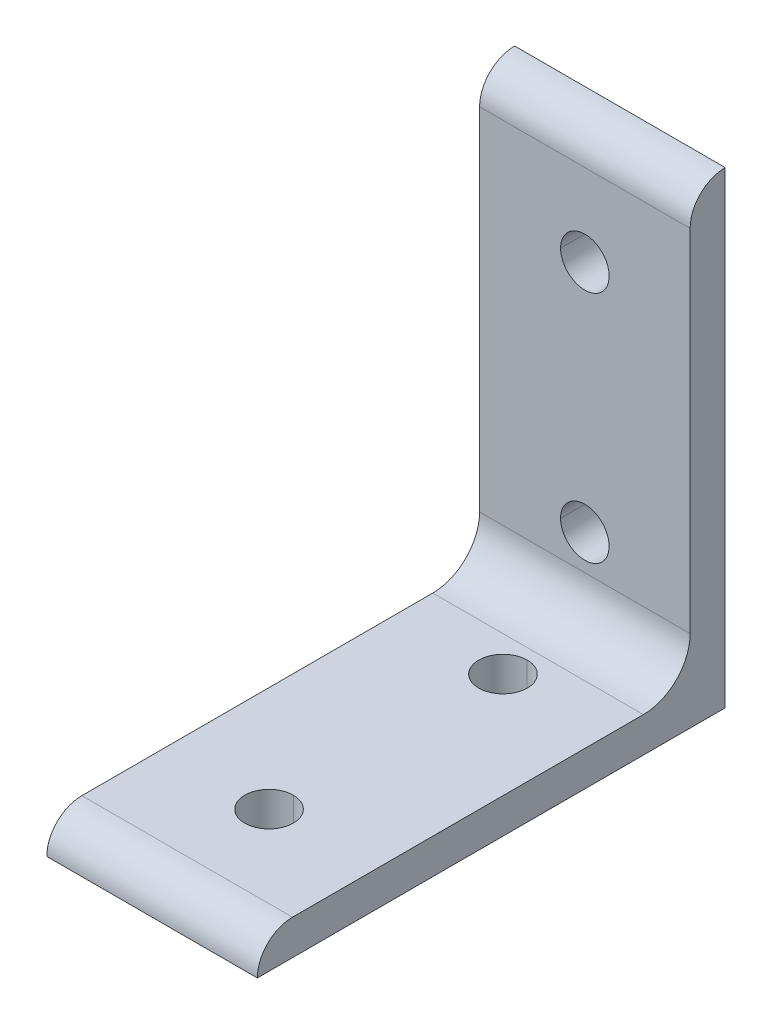
ISO-10303-21;
HEADER;
FILE_DESCRIPTION(('STEP AP214'),'2;1');
FILE_NAME('part.step','',(''),(''),'','','');
FILE_SCHEMA(('AUTOMOTIVE_DESIGN { 1 0 10303 214 1 1 1 1 }'));
ENDSEC;
DATA;
#1=APPLICATION_CONTEXT('core data for automotive mechanical design processes');
#2=APPLICATION_PROTOCOL_DEFINITION('international standard','automotive_design',2000,#1);
#3=PRODUCT_CONTEXT('',#1,'mechanical');
#4=PRODUCT('Part','Part','',(#3));
#5=PRODUCT_RELATED_PRODUCT_CATEGORY('part','',(#4));
#6=PRODUCT_DEFINITION_FORMATION('','',#4);
#7=PRODUCT_DEFINITION_CONTEXT('part definition',#1,'design');
#8=PRODUCT_DEFINITION('design','',#6,#7);
#9=PRODUCT_DEFINITION_SHAPE('','',#8);
#10=(LENGTH_UNIT() NAMED_UNIT(*) SI_UNIT(.MILLI.,.METRE.));
#11=(NAMED_UNIT(*) PLANE_ANGLE_UNIT() SI_UNIT($,.RADIAN.));
#12=(NAMED_UNIT(*) SI_UNIT($,.STERADIAN.) SOLID_ANGLE_UNIT());
#13=UNCERTAINTY_MEASURE_WITH_UNIT(LENGTH_MEASURE(1.E-05),#10,'distance_accuracy_value','');
#14=(GEOMETRIC_REPRESENTATION_CONTEXT(3) GLOBAL_UNCERTAINTY_ASSIGNED_CONTEXT((#13)) GLOBAL_UNIT_ASSIGNED_CONTEXT((#10,
#11,#12)) REPRESENTATION_CONTEXT('',''));
#15=CARTESIAN_POINT('',(0.,0.,0.));
#16=DIRECTION('',(0.,0.,1.));
#17=DIRECTION('',(1.,0.,0.));
#18=AXIS2_PLACEMENT_3D('',#15,#16,#17);
#19=CARTESIAN_POINT('',(18.,-4.64905891561784E-13,74.));
#20=DIRECTION('',(-1.,0.,0.));
#21=DIRECTION('',(0.,-0.707106781186575,-0.70710678118652));
#22=AXIS2_PLACEMENT_3D('',#19,#20,#21);
#23=CYLINDRICAL_SURFACE('',#22,6.00000000000047);
#24=CARTESIAN_POINT('',(-18.,-4.64905891561784E-13,74.));
#25=DIRECTION('',(1.,0.,0.));
#26=DIRECTION('',(0.,0.,-1.));
#27=AXIS2_PLACEMENT_3D('',#24,#25,#26);
#28=CIRCLE('',#27,6.00000000000047);
#29=CARTESIAN_POINT('',(-18.,6.,74.));
#30=VERTEX_POINT('',#29);
#31=CARTESIAN_POINT('',(-18.,0.,80.));
#32=VERTEX_POINT('',#31);
#33=EDGE_CURVE('E11',#30,#32,#28,.T.);
#34=ORIENTED_EDGE('',*,*,#33,.T.);
#35=DIRECTION('',(-1.,0.,0.));
#36=VECTOR('',#35,1.);
#37=CARTESIAN_POINT('',(18.,0.,80.));
#38=LINE('',#37,#36);
#39=CARTESIAN_POINT('',(18.,0.,80.));
#40=VERTEX_POINT('',#39);
#41=EDGE_CURVE('E24',#40,#32,#38,.T.);
#42=ORIENTED_EDGE('',*,*,#41,.F.);
#43=CARTESIAN_POINT('',(18.,-4.64905891561784E-13,74.));
#44=DIRECTION('',(1.,0.,0.));
#45=DIRECTION('',(0.,0.,-1.));
#46=AXIS2_PLACEMENT_3D('',#43,#44,#45);
#47=CIRCLE('',#46,6.00000000000047);
#48=CARTESIAN_POINT('',(18.,6.,74.));
#49=VERTEX_POINT('',#48);
#50=EDGE_CURVE('E305',#49,#40,#47,.T.);
#51=ORIENTED_EDGE('',*,*,#50,.F.);
#52=DIRECTION('',(-1.,0.,0.));
#53=VECTOR('',#52,1.);
#54=CARTESIAN_POINT('',(18.,6.,74.));
#55=LINE('',#54,#53);
#56=EDGE_CURVE('E301',#49,#30,#55,.T.);
#57=ORIENTED_EDGE('',*,*,#56,.T.);
#58=EDGE_LOOP('',(#34,#42,#51,#57));
#59=FACE_BOUND('',#58,.T.);
#60=ADVANCED_FACE('F16',(#59),#23,.T.);
#61=CARTESIAN_POINT('',(18.,6.,14.));
#62=DIRECTION('',(0.,-1.,0.));
#63=DIRECTION('',(0.,0.,-1.));
#64=AXIS2_PLACEMENT_3D('',#61,#62,#63);
#65=PLANE('',#64);
#66=CARTESIAN_POINT('',(0.,6.,60.));
#67=DIRECTION('',(0.,1.,0.));
#68=DIRECTION('',(1.,0.,0.));
#69=AXIS2_PLACEMENT_3D('',#66,#67,#68);
#70=CIRCLE('',#69,4.15);
#71=CARTESIAN_POINT('',(0.,6.,55.85));
#72=VERTEX_POINT('',#71);
#73=CARTESIAN_POINT('',(0.,6.,64.15));
#74=VERTEX_POINT('',#73);
#75=EDGE_CURVE('E296',#72,#74,#70,.T.);
#76=ORIENTED_EDGE('',*,*,#75,.F.);
#77=CARTESIAN_POINT('',(0.,6.,60.));
#78=DIRECTION('',(0.,1.,0.));
#79=DIRECTION('',(0.,0.,1.));
#80=AXIS2_PLACEMENT_3D('',#77,#78,#79);
#81=CIRCLE('',#80,4.15000000000001);
#82=EDGE_CURVE('E291',#74,#72,#81,.T.);
#83=ORIENTED_EDGE('',*,*,#82,.F.);
#84=EDGE_LOOP('',(#76,#83));
#85=FACE_BOUND('',#84,.T.);
#86=CARTESIAN_POINT('',(0.,6.,20.));
#87=DIRECTION('',(0.,1.,0.));
#88=DIRECTION('',(1.,0.,0.));
#89=AXIS2_PLACEMENT_3D('',#86,#87,#88);
#90=CIRCLE('',#89,4.15);
#91=CARTESIAN_POINT('',(0.,6.,15.85));
#92=VERTEX_POINT('',#91);
#93=CARTESIAN_POINT('',(0.,6.,24.15));
#94=VERTEX_POINT('',#93);
#95=EDGE_CURVE('E287',#92,#94,#90,.T.);
#96=ORIENTED_EDGE('',*,*,#95,.F.);
#97=CARTESIAN_POINT('',(0.,6.,20.));
#98=DIRECTION('',(0.,1.,0.));
#99=DIRECTION('',(0.,0.,1.));
#100=AXIS2_PLACEMENT_3D('',#97,#98,#99);
#101=CIRCLE('',#100,4.15);
#102=EDGE_CURVE('E141',#94,#92,#101,.T.);
#103=ORIENTED_EDGE('',*,*,#102,.F.);
#104=EDGE_LOOP('',(#96,#103));
#105=FACE_BOUND('',#104,.T.);
#106=DIRECTION('',(0.,0.,1.));
#107=VECTOR('',#106,1.);
#108=CARTESIAN_POINT('',(-18.,6.,14.));
#109=LINE('',#108,#107);
#110=CARTESIAN_POINT('',(-18.,6.,14.));
#111=VERTEX_POINT('',#110);
#112=EDGE_CURVE('E278',#111,#30,#109,.T.);
#113=ORIENTED_EDGE('',*,*,#112,.T.);
#114=ORIENTED_EDGE('',*,*,#56,.F.);
#115=DIRECTION('',(0.,0.,1.));
#116=VECTOR('',#115,1.);
#117=CARTESIAN_POINT('',(18.,6.,14.));
#118=LINE('',#117,#116);
#119=CARTESIAN_POINT('',(18.,6.,14.));
#120=VERTEX_POINT('',#119);
#121=EDGE_CURVE('E273',#120,#49,#118,.T.);
#122=ORIENTED_EDGE('',*,*,#121,.F.);
#123=DIRECTION('',(-1.,0.,0.));
#124=VECTOR('',#123,1.);
#125=CARTESIAN_POINT('',(18.,6.,14.));
#126=LINE('',#125,#124);
#127=EDGE_CURVE('E268',#120,#111,#126,.T.);
#128=ORIENTED_EDGE('',*,*,#127,.T.);
#129=EDGE_LOOP('',(#113,#114,#122,#128));
#130=FACE_BOUND('',#129,.T.);
#131=ADVANCED_FACE('F322',(#85,#105,#130),#65,.F.);
#132=CARTESIAN_POINT('',(18.,14.,14.));
#133=DIRECTION('',(-1.,0.,0.));
#134=DIRECTION('',(0.,0.707106781186548,0.707106781186548));
#135=AXIS2_PLACEMENT_3D('',#132,#133,#134);
#136=CYLINDRICAL_SURFACE('',#135,8.);
#137=CARTESIAN_POINT('',(-18.,14.,14.));
#138=DIRECTION('',(1.,0.,0.));
#139=DIRECTION('',(0.,0.,-1.));
#140=AXIS2_PLACEMENT_3D('',#137,#138,#139);
#141=CIRCLE('',#140,8.);
#142=CARTESIAN_POINT('',(-18.,14.,6.));
#143=VERTEX_POINT('',#142);
#144=EDGE_CURVE('E262',#111,#143,#141,.T.);
#145=ORIENTED_EDGE('',*,*,#144,.F.);
#146=ORIENTED_EDGE('',*,*,#127,.F.);
#147=CARTESIAN_POINT('',(18.,14.,14.));
#148=DIRECTION('',(1.,0.,0.));
#149=DIRECTION('',(0.,0.,-1.));
#150=AXIS2_PLACEMENT_3D('',#147,#148,#149);
#151=CIRCLE('',#150,8.);
#152=CARTESIAN_POINT('',(18.,14.,6.));
#153=VERTEX_POINT('',#152);
#154=EDGE_CURVE('E258',#120,#153,#151,.T.);
#155=ORIENTED_EDGE('',*,*,#154,.T.);
#156=DIRECTION('',(-1.,0.,0.));
#157=VECTOR('',#156,1.);
#158=CARTESIAN_POINT('',(18.,14.,6.));
#159=LINE('',#158,#157);
#160=EDGE_CURVE('E254',#153,#143,#159,.T.);
#161=ORIENTED_EDGE('',*,*,#160,.T.);
#162=EDGE_LOOP('',(#145,#146,#155,#161));
#163=FACE_BOUND('',#162,.T.);
#164=ADVANCED_FACE('F339',(#163),#136,.F.);
#165=CARTESIAN_POINT('',(18.,74.,6.));
#166=DIRECTION('',(0.,0.,-1.));
#167=DIRECTION('',(-1.,0.,0.));
#168=AXIS2_PLACEMENT_3D('',#165,#166,#167);
#169=PLANE('',#168);
#170=CARTESIAN_POINT('',(0.,60.,6.));
#171=DIRECTION('',(0.,0.,1.));
#172=DIRECTION('',(1.,0.,0.));
#173=AXIS2_PLACEMENT_3D('',#170,#171,#172);
#174=CIRCLE('',#173,4.15);
#175=CARTESIAN_POINT('',(-4.15,60.,6.));
#176=VERTEX_POINT('',#175);
#177=CARTESIAN_POINT('',(4.15,60.,6.));
#178=VERTEX_POINT('',#177);
#179=EDGE_CURVE('E249',#176,#178,#174,.T.);
#180=ORIENTED_EDGE('',*,*,#179,.F.);
#181=CARTESIAN_POINT('',(0.,60.,6.));
#182=DIRECTION('',(0.,0.,1.));
#183=DIRECTION('',(1.,0.,0.));
#184=AXIS2_PLACEMENT_3D('',#181,#182,#183);
#185=CIRCLE('',#184,4.15);
#186=EDGE_CURVE('E244',#178,#176,#185,.T.);
#187=ORIENTED_EDGE('',*,*,#186,.F.);
#188=EDGE_LOOP('',(#180,#187));
#189=FACE_BOUND('',#188,.T.);
#190=CARTESIAN_POINT('',(0.,20.,6.));
#191=DIRECTION('',(0.,0.,1.));
#192=DIRECTION('',(1.,0.,0.));
#193=AXIS2_PLACEMENT_3D('',#190,#191,#192);
#194=CIRCLE('',#193,4.15);
#195=CARTESIAN_POINT('',(-4.15,20.,6.));
#196=VERTEX_POINT('',#195);
#197=CARTESIAN_POINT('',(4.15,20.,6.));
#198=VERTEX_POINT('',#197);
#199=EDGE_CURVE('E239',#196,#198,#194,.T.);
#200=ORIENTED_EDGE('',*,*,#199,.F.);
#201=CARTESIAN_POINT('',(0.,20.,6.));
#202=DIRECTION('',(0.,0.,1.));
#203=DIRECTION('',(1.,0.,0.));
#204=AXIS2_PLACEMENT_3D('',#201,#202,#203);
#205=CIRCLE('',#204,4.15);
#206=EDGE_CURVE('E234',#198,#196,#205,.T.);
#207=ORIENTED_EDGE('',*,*,#206,.F.);
#208=EDGE_LOOP('',(#200,#207));
#209=FACE_BOUND('',#208,.T.);
#210=DIRECTION('',(0.,-1.,0.));
#211=VECTOR('',#210,1.);
#212=CARTESIAN_POINT('',(-18.,74.,6.));
#213=LINE('',#212,#211);
#214=CARTESIAN_POINT('',(-18.,74.,6.));
#215=VERTEX_POINT('',#214);
#216=EDGE_CURVE('E229',#215,#143,#213,.T.);
#217=ORIENTED_EDGE('',*,*,#216,.T.);
#218=ORIENTED_EDGE('',*,*,#160,.F.);
#219=DIRECTION('',(0.,-1.,0.));
#220=VECTOR('',#219,1.);
#221=CARTESIAN_POINT('',(18.,74.,6.));
#222=LINE('',#221,#220);
#223=CARTESIAN_POINT('',(18.,74.,6.));
#224=VERTEX_POINT('',#223);
#225=EDGE_CURVE('E224',#224,#153,#222,.T.);
#226=ORIENTED_EDGE('',*,*,#225,.F.);
#227=DIRECTION('',(-1.,0.,0.));
#228=VECTOR('',#227,1.);
#229=CARTESIAN_POINT('',(18.,74.,6.));
#230=LINE('',#229,#228);
#231=EDGE_CURVE('E220',#224,#215,#230,.T.);
#232=ORIENTED_EDGE('',*,*,#231,.T.);
#233=EDGE_LOOP('',(#217,#218,#226,#232));
#234=FACE_BOUND('',#233,.T.);
#235=ADVANCED_FACE('F337',(#189,#209,#234),#169,.F.);
#236=CARTESIAN_POINT('',(18.,74.,-4.65339572430779E-13));
#237=DIRECTION('',(-1.,0.,0.));
#238=DIRECTION('',(0.,-0.70710678118652,-0.707106781186575));
#239=AXIS2_PLACEMENT_3D('',#236,#237,#238);
#240=CYLINDRICAL_SURFACE('',#239,6.00000000000046);
#241=CARTESIAN_POINT('',(-18.,74.,-4.65339572430779E-13));
#242=DIRECTION('',(1.,0.,0.));
#243=DIRECTION('',(0.,0.,-1.));
#244=AXIS2_PLACEMENT_3D('',#241,#242,#243);
#245=CIRCLE('',#244,6.00000000000046);
#246=CARTESIAN_POINT('',(-18.,80.,0.));
#247=VERTEX_POINT('',#246);
#248=EDGE_CURVE('E215',#247,#215,#245,.T.);
#249=ORIENTED_EDGE('',*,*,#248,.T.);
#250=ORIENTED_EDGE('',*,*,#231,.F.);
#251=CARTESIAN_POINT('',(18.,74.,-4.65339572430779E-13));
#252=DIRECTION('',(1.,0.,0.));
#253=DIRECTION('',(0.,0.,-1.));
#254=AXIS2_PLACEMENT_3D('',#251,#252,#253);
#255=CIRCLE('',#254,6.00000000000046);
#256=CARTESIAN_POINT('',(18.,80.,0.));
#257=VERTEX_POINT('',#256);
#258=EDGE_CURVE('E210',#257,#224,#255,.T.);
#259=ORIENTED_EDGE('',*,*,#258,.F.);
#260=DIRECTION('',(-1.,0.,0.));
#261=VECTOR('',#260,1.);
#262=CARTESIAN_POINT('',(18.,80.,0.));
#263=LINE('',#262,#261);
#264=EDGE_CURVE('E206',#257,#247,#263,.T.);
#265=ORIENTED_EDGE('',*,*,#264,.T.);
#266=EDGE_LOOP('',(#249,#250,#259,#265));
#267=FACE_BOUND('',#266,.T.);
#268=ADVANCED_FACE('F335',(#267),#240,.T.);
#269=CARTESIAN_POINT('',(18.,0.,0.));
#270=DIRECTION('',(0.,0.,1.));
#271=DIRECTION('',(1.,0.,0.));
#272=AXIS2_PLACEMENT_3D('',#269,#270,#271);
#273=PLANE('',#272);
#274=CARTESIAN_POINT('',(0.,60.,0.));
#275=DIRECTION('',(0.,0.,1.));
#276=DIRECTION('',(1.,0.,0.));
#277=AXIS2_PLACEMENT_3D('',#274,#275,#276);
#278=CIRCLE('',#277,4.15);
#279=CARTESIAN_POINT('',(4.15,60.,0.));
#280=VERTEX_POINT('',#279);
#281=CARTESIAN_POINT('',(-4.15,60.,0.));
#282=VERTEX_POINT('',#281);
#283=EDGE_CURVE('E202',#280,#282,#278,.T.);
#284=ORIENTED_EDGE('',*,*,#283,.T.);
#285=CARTESIAN_POINT('',(0.,60.,0.));
#286=DIRECTION('',(0.,0.,1.));
#287=DIRECTION('',(1.,0.,0.));
#288=AXIS2_PLACEMENT_3D('',#285,#286,#287);
#289=CIRCLE('',#288,4.15);
#290=EDGE_CURVE('E198',#282,#280,#289,.T.);
#291=ORIENTED_EDGE('',*,*,#290,.T.);
#292=EDGE_LOOP('',(#284,#291));
#293=FACE_BOUND('',#292,.T.);
#294=CARTESIAN_POINT('',(0.,20.,0.));
#295=DIRECTION('',(0.,0.,1.));
#296=DIRECTION('',(1.,0.,0.));
#297=AXIS2_PLACEMENT_3D('',#294,#295,#296);
#298=CIRCLE('',#297,4.15);
#299=CARTESIAN_POINT('',(4.15,20.,0.));
#300=VERTEX_POINT('',#299);
#301=CARTESIAN_POINT('',(-4.15,20.,0.));
#302=VERTEX_POINT('',#301);
#303=EDGE_CURVE('E194',#300,#302,#298,.T.);
#304=ORIENTED_EDGE('',*,*,#303,.T.);
#305=CARTESIAN_POINT('',(0.,20.,0.));
#306=DIRECTION('',(0.,0.,1.));
#307=DIRECTION('',(1.,0.,0.));
#308=AXIS2_PLACEMENT_3D('',#305,#306,#307);
#309=CIRCLE('',#308,4.15);
#310=EDGE_CURVE('E190',#302,#300,#309,.T.);
#311=ORIENTED_EDGE('',*,*,#310,.T.);
#312=EDGE_LOOP('',(#304,#311));
#313=FACE_BOUND('',#312,.T.);
#314=DIRECTION('',(0.,1.,0.));
#315=VECTOR('',#314,1.);
#316=CARTESIAN_POINT('',(-18.,0.,0.));
#317=LINE('',#316,#315);
#318=CARTESIAN_POINT('',(-18.,0.,0.));
#319=VERTEX_POINT('',#318);
#320=EDGE_CURVE('E184',#319,#247,#317,.T.);
#321=ORIENTED_EDGE('',*,*,#320,.T.);
#322=ORIENTED_EDGE('',*,*,#264,.F.);
#323=DIRECTION('',(0.,1.,0.));
#324=VECTOR('',#323,1.);
#325=CARTESIAN_POINT('',(18.,0.,0.));
#326=LINE('',#325,#324);
#327=CARTESIAN_POINT('',(18.,0.,0.));
#328=VERTEX_POINT('',#327);
#329=EDGE_CURVE('E179',#328,#257,#326,.T.);
#330=ORIENTED_EDGE('',*,*,#329,.F.);
#331=DIRECTION('',(-1.,0.,0.));
#332=VECTOR('',#331,1.);
#333=CARTESIAN_POINT('',(18.,0.,0.));
#334=LINE('',#333,#332);
#335=EDGE_CURVE('E174',#328,#319,#334,.T.);
#336=ORIENTED_EDGE('',*,*,#335,.T.);
#337=EDGE_LOOP('',(#321,#322,#330,#336));
#338=FACE_BOUND('',#337,.T.);
#339=ADVANCED_FACE('F331',(#293,#313,#338),#273,.F.);
#340=CARTESIAN_POINT('',(18.,0.,80.));
#341=DIRECTION('',(0.,1.,0.));
#342=DIRECTION('',(0.,0.,1.));
#343=AXIS2_PLACEMENT_3D('',#340,#341,#342);
#344=PLANE('',#343);
#345=CARTESIAN_POINT('',(0.,0.,60.));
#346=DIRECTION('',(0.,1.,0.));
#347=DIRECTION('',(1.,0.,0.));
#348=AXIS2_PLACEMENT_3D('',#345,#346,#347);
#349=CIRCLE('',#348,4.15);
#350=CARTESIAN_POINT('',(0.,0.,55.85));
#351=VERTEX_POINT('',#350);
#352=CARTESIAN_POINT('',(0.,0.,64.15));
#353=VERTEX_POINT('',#352);
#354=EDGE_CURVE('E170',#351,#353,#349,.T.);
#355=ORIENTED_EDGE('',*,*,#354,.T.);
#356=CARTESIAN_POINT('',(0.,0.,60.));
#357=DIRECTION('',(0.,1.,0.));
#358=DIRECTION('',(0.,0.,1.));
#359=AXIS2_PLACEMENT_3D('',#356,#357,#358);
#360=CIRCLE('',#359,4.15000000000001);
#361=EDGE_CURVE('E138',#353,#351,#360,.T.);
#362=ORIENTED_EDGE('',*,*,#361,.T.);
#363=EDGE_LOOP('',(#355,#362));
#364=FACE_BOUND('',#363,.T.);
#365=CARTESIAN_POINT('',(0.,0.,20.));
#366=DIRECTION('',(0.,1.,0.));
#367=DIRECTION('',(1.,0.,0.));
#368=AXIS2_PLACEMENT_3D('',#365,#366,#367);
#369=CIRCLE('',#368,4.15);
#370=CARTESIAN_POINT('',(0.,0.,15.85));
#371=VERTEX_POINT('',#370);
#372=CARTESIAN_POINT('',(0.,0.,24.15));
#373=VERTEX_POINT('',#372);
#374=EDGE_CURVE('E124',#371,#373,#369,.T.);
#375=ORIENTED_EDGE('',*,*,#374,.T.);
#376=CARTESIAN_POINT('',(0.,0.,20.));
#377=DIRECTION('',(0.,1.,0.));
#378=DIRECTION('',(0.,0.,1.));
#379=AXIS2_PLACEMENT_3D('',#376,#377,#378);
#380=CIRCLE('',#379,4.15);
#381=EDGE_CURVE('E120',#373,#371,#380,.T.);
#382=ORIENTED_EDGE('',*,*,#381,.T.);
#383=EDGE_LOOP('',(#375,#382));
#384=FACE_BOUND('',#383,.T.);
#385=DIRECTION('',(0.,0.,-1.));
#386=VECTOR('',#385,1.);
#387=CARTESIAN_POINT('',(-18.,0.,80.));
#388=LINE('',#387,#386);
#389=EDGE_CURVE('E129',#32,#319,#388,.T.);
#390=ORIENTED_EDGE('',*,*,#389,.T.);
#391=ORIENTED_EDGE('',*,*,#335,.F.);
#392=DIRECTION('',(0.,0.,-1.));
#393=VECTOR('',#392,1.);
#394=CARTESIAN_POINT('',(18.,0.,80.));
#395=LINE('',#394,#393);
#396=EDGE_CURVE('E144',#40,#328,#395,.T.);
#397=ORIENTED_EDGE('',*,*,#396,.F.);
#398=ORIENTED_EDGE('',*,*,#41,.T.);
#399=EDGE_LOOP('',(#390,#391,#397,#398));
#400=FACE_BOUND('',#399,.T.);
#401=ADVANCED_FACE('F122',(#364,#384,#400),#344,.F.);
#402=CARTESIAN_POINT('',(18.,-4.64905891561784E-13,74.));
#403=DIRECTION('',(1.,0.,0.));
#404=DIRECTION('',(0.,0.,-1.));
#405=AXIS2_PLACEMENT_3D('',#402,#403,#404);
#406=PLANE('',#405);
#407=ORIENTED_EDGE('',*,*,#50,.T.);
#408=ORIENTED_EDGE('',*,*,#396,.T.);
#409=ORIENTED_EDGE('',*,*,#329,.T.);
#410=ORIENTED_EDGE('',*,*,#258,.T.);
#411=ORIENTED_EDGE('',*,*,#225,.T.);
#412=ORIENTED_EDGE('',*,*,#154,.F.);
#413=ORIENTED_EDGE('',*,*,#121,.T.);
#414=EDGE_LOOP('',(#407,#408,#409,#410,#411,#412,#413));
#415=FACE_BOUND('',#414,.T.);
#416=ADVANCED_FACE('F317',(#415),#406,.T.);
#417=CARTESIAN_POINT('',(-18.,-4.64905891561784E-13,74.));
#418=DIRECTION('',(1.,0.,0.));
#419=DIRECTION('',(0.,0.,-1.));
#420=AXIS2_PLACEMENT_3D('',#417,#418,#419);
#421=PLANE('',#420);
#422=ORIENTED_EDGE('',*,*,#33,.F.);
#423=ORIENTED_EDGE('',*,*,#112,.F.);
#424=ORIENTED_EDGE('',*,*,#144,.T.);
#425=ORIENTED_EDGE('',*,*,#216,.F.);
#426=ORIENTED_EDGE('',*,*,#248,.F.);
#427=ORIENTED_EDGE('',*,*,#320,.F.);
#428=ORIENTED_EDGE('',*,*,#389,.F.);
#429=EDGE_LOOP('',(#422,#423,#424,#425,#426,#427,#428));
#430=FACE_BOUND('',#429,.T.);
#431=ADVANCED_FACE('F326',(#430),#421,.F.);
#432=CARTESIAN_POINT('',(0.,6.,20.));
#433=DIRECTION('',(0.,-1.,0.));
#434=DIRECTION('',(-1.,0.,0.));
#435=AXIS2_PLACEMENT_3D('',#432,#433,#434);
#436=CYLINDRICAL_SURFACE('',#435,4.15);
#437=DIRECTION('',(0.,-1.,0.));
#438=VECTOR('',#437,1.);
#439=CARTESIAN_POINT('',(0.,6.,24.15));
#440=LINE('',#439,#438);
#441=EDGE_CURVE('E137',#94,#373,#440,.T.);
#442=ORIENTED_EDGE('',*,*,#441,.F.);
#443=ORIENTED_EDGE('',*,*,#102,.T.);
#444=DIRECTION('',(0.,-1.,0.));
#445=VECTOR('',#444,1.);
#446=CARTESIAN_POINT('',(0.,6.,15.85));
#447=LINE('',#446,#445);
#448=EDGE_CURVE('E135',#92,#371,#447,.T.);
#449=ORIENTED_EDGE('',*,*,#448,.T.);
#450=ORIENTED_EDGE('',*,*,#381,.F.);
#451=EDGE_LOOP('',(#442,#443,#449,#450));
#452=FACE_BOUND('',#451,.T.);
#453=ADVANCED_FACE('F140',(#452),#436,.F.);
#454=CARTESIAN_POINT('',(0.,6.,20.));
#455=DIRECTION('',(0.,-1.,0.));
#456=DIRECTION('',(1.,0.,0.));
#457=AXIS2_PLACEMENT_3D('',#454,#455,#456);
#458=CYLINDRICAL_SURFACE('',#457,4.15);
#459=ORIENTED_EDGE('',*,*,#441,.T.);
#460=ORIENTED_EDGE('',*,*,#374,.F.);
#461=ORIENTED_EDGE('',*,*,#448,.F.);
#462=ORIENTED_EDGE('',*,*,#95,.T.);
#463=EDGE_LOOP('',(#459,#460,#461,#462));
#464=FACE_BOUND('',#463,.T.);
#465=ADVANCED_FACE('F133',(#464),#458,.F.);
#466=CARTESIAN_POINT('',(0.,6.,60.));
#467=DIRECTION('',(0.,-1.,0.));
#468=DIRECTION('',(-1.,0.,0.));
#469=AXIS2_PLACEMENT_3D('',#466,#467,#468);
#470=CYLINDRICAL_SURFACE('',#469,4.15);
#471=DIRECTION('',(0.,-1.,0.));
#472=VECTOR('',#471,1.);
#473=CARTESIAN_POINT('',(0.,6.,64.15));
#474=LINE('',#473,#472);
#475=EDGE_CURVE('E142',#74,#353,#474,.T.);
#476=ORIENTED_EDGE('',*,*,#475,.F.);
#477=ORIENTED_EDGE('',*,*,#82,.T.);
#478=DIRECTION('',(0.,-1.,0.));
#479=VECTOR('',#478,1.);
#480=CARTESIAN_POINT('',(0.,6.,55.85));
#481=LINE('',#480,#479);
#482=EDGE_CURVE('E147',#72,#351,#481,.T.);
#483=ORIENTED_EDGE('',*,*,#482,.T.);
#484=ORIENTED_EDGE('',*,*,#361,.F.);
#485=EDGE_LOOP('',(#476,#477,#483,#484));
#486=FACE_BOUND('',#485,.T.);
#487=ADVANCED_FACE('F441',(#486),#470,.F.);
#488=CARTESIAN_POINT('',(0.,6.,60.));
#489=DIRECTION('',(0.,-1.,0.));
#490=DIRECTION('',(1.,0.,0.));
#491=AXIS2_PLACEMENT_3D('',#488,#489,#490);
#492=CYLINDRICAL_SURFACE('',#491,4.15);
#493=ORIENTED_EDGE('',*,*,#475,.T.);
#494=ORIENTED_EDGE('',*,*,#354,.F.);
#495=ORIENTED_EDGE('',*,*,#482,.F.);
#496=ORIENTED_EDGE('',*,*,#75,.T.);
#497=EDGE_LOOP('',(#493,#494,#495,#496));
#498=FACE_BOUND('',#497,.T.);
#499=ADVANCED_FACE('F451',(#498),#492,.F.);
#500=CARTESIAN_POINT('',(0.,20.,6.));
#501=DIRECTION('',(0.,0.,-1.));
#502=DIRECTION('',(0.,1.,0.));
#503=AXIS2_PLACEMENT_3D('',#500,#501,#502);
#504=CYLINDRICAL_SURFACE('',#503,4.15);
#505=DIRECTION('',(0.,0.,-1.));
#506=VECTOR('',#505,1.);
#507=CARTESIAN_POINT('',(4.15,20.,6.));
#508=LINE('',#507,#506);
#509=EDGE_CURVE('E552',#198,#300,#508,.T.);
#510=ORIENTED_EDGE('',*,*,#509,.T.);
#511=ORIENTED_EDGE('',*,*,#310,.F.);
#512=DIRECTION('',(0.,0.,-1.));
#513=VECTOR('',#512,1.);
#514=CARTESIAN_POINT('',(-4.15,20.,6.));
#515=LINE('',#514,#513);
#516=EDGE_CURVE('E541',#196,#302,#515,.T.);
#517=ORIENTED_EDGE('',*,*,#516,.F.);
#518=ORIENTED_EDGE('',*,*,#199,.T.);
#519=EDGE_LOOP('',(#510,#511,#517,#518));
#520=FACE_BOUND('',#519,.T.);
#521=ADVANCED_FACE('F462',(#520),#504,.F.);
#522=CARTESIAN_POINT('',(0.,20.,6.));
#523=DIRECTION('',(0.,0.,-1.));
#524=DIRECTION('',(0.,-1.,0.));
#525=AXIS2_PLACEMENT_3D('',#522,#523,#524);
#526=CYLINDRICAL_SURFACE('',#525,4.15);
#527=ORIENTED_EDGE('',*,*,#509,.F.);
#528=ORIENTED_EDGE('',*,*,#206,.T.);
#529=ORIENTED_EDGE('',*,*,#516,.T.);
#530=ORIENTED_EDGE('',*,*,#303,.F.);
#531=EDGE_LOOP('',(#527,#528,#529,#530));
#532=FACE_BOUND('',#531,.T.);
#533=ADVANCED_FACE('F473',(#532),#526,.F.);
#534=CARTESIAN_POINT('',(0.,60.,6.));
#535=DIRECTION('',(0.,0.,-1.));
#536=DIRECTION('',(0.,1.,0.));
#537=AXIS2_PLACEMENT_3D('',#534,#535,#536);
#538=CYLINDRICAL_SURFACE('',#537,4.15);
#539=DIRECTION('',(0.,0.,-1.));
#540=VECTOR('',#539,1.);
#541=CARTESIAN_POINT('',(4.15,60.,6.));
#542=LINE('',#541,#540);
#543=EDGE_CURVE('E538',#178,#280,#542,.T.);
#544=ORIENTED_EDGE('',*,*,#543,.T.);
#545=ORIENTED_EDGE('',*,*,#290,.F.);
#546=DIRECTION('',(0.,0.,-1.));
#547=VECTOR('',#546,1.);
#548=CARTESIAN_POINT('',(-4.15,60.,6.));
#549=LINE('',#548,#547);
#550=EDGE_CURVE('E542',#176,#282,#549,.T.);
#551=ORIENTED_EDGE('',*,*,#550,.F.);
#552=ORIENTED_EDGE('',*,*,#179,.T.);
#553=EDGE_LOOP('',(#544,#545,#551,#552));
#554=FACE_BOUND('',#553,.T.);
#555=ADVANCED_FACE('F484',(#554),#538,.F.);
#556=CARTESIAN_POINT('',(0.,60.,6.));
#557=DIRECTION('',(0.,0.,-1.));
#558=DIRECTION('',(0.,-1.,0.));
#559=AXIS2_PLACEMENT_3D('',#556,#557,#558);
#560=CYLINDRICAL_SURFACE('',#559,4.15);
#561=ORIENTED_EDGE('',*,*,#543,.F.);
#562=ORIENTED_EDGE('',*,*,#186,.T.);
#563=ORIENTED_EDGE('',*,*,#550,.T.);
#564=ORIENTED_EDGE('',*,*,#283,.F.);
#565=EDGE_LOOP('',(#561,#562,#563,#564));
#566=FACE_BOUND('',#565,.T.);
#567=ADVANCED_FACE('F495',(#566),#560,.F.);
#568=CLOSED_SHELL('',(#60,#131,#164,#235,#268,#339,#401,#416,#431,#453,#465,#487,#499,#521,#533,
#555,#567));
#569=MANIFOLD_SOLID_BREP('B1',#568);
#570=ADVANCED_BREP_SHAPE_REPRESENTATION('',(#18,#569),#14);
#571=SHAPE_DEFINITION_REPRESENTATION(#9,#570);
ENDSEC;
END-ISO-10303-21;
